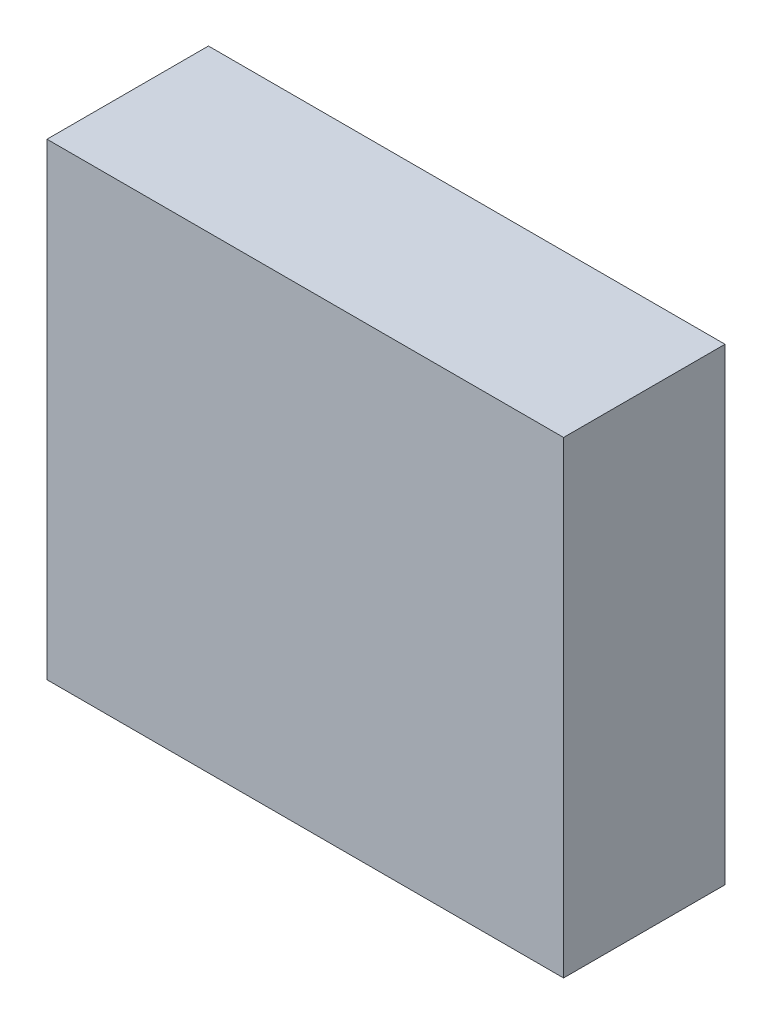
ISO-10303-21;
HEADER;
FILE_DESCRIPTION(('STEP AP214'),'2;1');
FILE_NAME('part.step','',(''),(''),'','','');
FILE_SCHEMA(('AUTOMOTIVE_DESIGN { 1 0 10303 214 1 1 1 1 }'));
ENDSEC;
DATA;
#1=APPLICATION_CONTEXT('core data for automotive mechanical design processes');
#2=APPLICATION_PROTOCOL_DEFINITION('international standard','automotive_design',2000,#1);
#3=PRODUCT_CONTEXT('',#1,'mechanical');
#4=PRODUCT('Part','Part','',(#3));
#5=PRODUCT_RELATED_PRODUCT_CATEGORY('part','',(#4));
#6=PRODUCT_DEFINITION_FORMATION('','',#4);
#7=PRODUCT_DEFINITION_CONTEXT('part definition',#1,'design');
#8=PRODUCT_DEFINITION('design','',#6,#7);
#9=PRODUCT_DEFINITION_SHAPE('','',#8);
#10=(LENGTH_UNIT() NAMED_UNIT(*) SI_UNIT(.MILLI.,.METRE.));
#11=(NAMED_UNIT(*) PLANE_ANGLE_UNIT() SI_UNIT($,.RADIAN.));
#12=(NAMED_UNIT(*) SI_UNIT($,.STERADIAN.) SOLID_ANGLE_UNIT());
#13=UNCERTAINTY_MEASURE_WITH_UNIT(LENGTH_MEASURE(1.E-05),#10,'distance_accuracy_value','');
#14=(GEOMETRIC_REPRESENTATION_CONTEXT(3) GLOBAL_UNCERTAINTY_ASSIGNED_CONTEXT((#13)) GLOBAL_UNIT_ASSIGNED_CONTEXT((#10,
#11,#12)) REPRESENTATION_CONTEXT('',''));
#15=CARTESIAN_POINT('',(0.,0.,0.));
#16=DIRECTION('',(0.,0.,1.));
#17=DIRECTION('',(1.,0.,0.));
#18=AXIS2_PLACEMENT_3D('',#15,#16,#17);
#19=CARTESIAN_POINT('',(-0.800018310546875,-0.724998474121094,-2.64111989736557));
#20=DIRECTION('',(0.,-1.,0.));
#21=DIRECTION('',(1.,0.,0.));
#22=AXIS2_PLACEMENT_3D('',#19,#20,#21);
#23=PLANE('',#22);
#24=DIRECTION('',(1.,0.,0.));
#25=VECTOR('',#24,1.);
#26=CARTESIAN_POINT('',(-0.800018310546875,-0.724998474121094,-2.64111989736557));
#27=LINE('',#26,#25);
#28=CARTESIAN_POINT('',(-0.800018310546875,-0.724998474121094,-2.64111989736557));
#29=VERTEX_POINT('',#28);
#30=CARTESIAN_POINT('',(0.800018310546875,-0.724998474121094,-2.64111989736557));
#31=VERTEX_POINT('',#30);
#32=EDGE_CURVE('E11',#29,#31,#27,.T.);
#33=ORIENTED_EDGE('',*,*,#32,.T.);
#34=DIRECTION('',(0.,0.,1.));
#35=VECTOR('',#34,1.);
#36=CARTESIAN_POINT('',(0.800018310546875,-0.724998474121094,-2.64111989736557));
#37=LINE('',#36,#35);
#38=CARTESIAN_POINT('',(0.800018310546875,-0.724998474121094,-2.14112091064453));
#39=VERTEX_POINT('',#38);
#40=EDGE_CURVE('E88',#31,#39,#37,.T.);
#41=ORIENTED_EDGE('',*,*,#40,.T.);
#42=DIRECTION('',(1.,0.,0.));
#43=VECTOR('',#42,1.);
#44=CARTESIAN_POINT('',(-0.800018310546875,-0.724998474121094,-2.14112091064453));
#45=LINE('',#44,#43);
#46=CARTESIAN_POINT('',(-0.800018310546875,-0.724998474121094,-2.14112091064453));
#47=VERTEX_POINT('',#46);
#48=EDGE_CURVE('E83',#47,#39,#45,.T.);
#49=ORIENTED_EDGE('',*,*,#48,.F.);
#50=DIRECTION('',(0.,0.,1.));
#51=VECTOR('',#50,1.);
#52=CARTESIAN_POINT('',(-0.800018310546875,-0.724998474121094,-2.64111989736557));
#53=LINE('',#52,#51);
#54=EDGE_CURVE('E72',#29,#47,#53,.T.);
#55=ORIENTED_EDGE('',*,*,#54,.F.);
#56=EDGE_LOOP('',(#33,#41,#49,#55));
#57=FACE_BOUND('',#56,.T.);
#58=ADVANCED_FACE('F17',(#57),#23,.T.);
#59=CARTESIAN_POINT('',(0.800018310546875,-0.724998474121094,-2.64111989736557));
#60=DIRECTION('',(1.,0.,0.));
#61=DIRECTION('',(0.,1.,0.));
#62=AXIS2_PLACEMENT_3D('',#59,#60,#61);
#63=PLANE('',#62);
#64=DIRECTION('',(0.,1.,0.));
#65=VECTOR('',#64,1.);
#66=CARTESIAN_POINT('',(0.800018310546875,-0.724998474121094,-2.64111989736557));
#67=LINE('',#66,#65);
#68=CARTESIAN_POINT('',(0.800018310546875,0.724998474121094,-2.64111989736557));
#69=VERTEX_POINT('',#68);
#70=EDGE_CURVE('E24',#31,#69,#67,.T.);
#71=ORIENTED_EDGE('',*,*,#70,.T.);
#72=DIRECTION('',(0.,0.,1.));
#73=VECTOR('',#72,1.);
#74=CARTESIAN_POINT('',(0.800018310546875,0.724998474121094,-2.64111989736557));
#75=LINE('',#74,#73);
#76=CARTESIAN_POINT('',(0.800018310546875,0.724998474121094,-2.14112091064453));
#77=VERTEX_POINT('',#76);
#78=EDGE_CURVE('E85',#69,#77,#75,.T.);
#79=ORIENTED_EDGE('',*,*,#78,.T.);
#80=DIRECTION('',(0.,1.,0.));
#81=VECTOR('',#80,1.);
#82=CARTESIAN_POINT('',(0.800018310546875,-0.724998474121094,-2.14112091064453));
#83=LINE('',#82,#81);
#84=EDGE_CURVE('E66',#39,#77,#83,.T.);
#85=ORIENTED_EDGE('',*,*,#84,.F.);
#86=ORIENTED_EDGE('',*,*,#40,.F.);
#87=EDGE_LOOP('',(#71,#79,#85,#86));
#88=FACE_BOUND('',#87,.T.);
#89=ADVANCED_FACE('F89',(#88),#63,.T.);
#90=CARTESIAN_POINT('',(0.800018310546875,0.724998474121094,-2.64111989736557));
#91=DIRECTION('',(0.,1.,0.));
#92=DIRECTION('',(-1.,0.,0.));
#93=AXIS2_PLACEMENT_3D('',#90,#91,#92);
#94=PLANE('',#93);
#95=DIRECTION('',(-1.,0.,0.));
#96=VECTOR('',#95,1.);
#97=CARTESIAN_POINT('',(0.800018310546875,0.724998474121094,-2.64111989736557));
#98=LINE('',#97,#96);
#99=CARTESIAN_POINT('',(-0.800018310546875,0.724998474121094,-2.64111989736557));
#100=VERTEX_POINT('',#99);
#101=EDGE_CURVE('E62',#69,#100,#98,.T.);
#102=ORIENTED_EDGE('',*,*,#101,.T.);
#103=DIRECTION('',(0.,0.,1.));
#104=VECTOR('',#103,1.);
#105=CARTESIAN_POINT('',(-0.800018310546875,0.724998474121094,-2.64111989736557));
#106=LINE('',#105,#104);
#107=CARTESIAN_POINT('',(-0.800018310546875,0.724998474121094,-2.14112091064453));
#108=VERTEX_POINT('',#107);
#109=EDGE_CURVE('E55',#100,#108,#106,.T.);
#110=ORIENTED_EDGE('',*,*,#109,.T.);
#111=DIRECTION('',(-1.,0.,0.));
#112=VECTOR('',#111,1.);
#113=CARTESIAN_POINT('',(0.800018310546875,0.724998474121094,-2.14112091064453));
#114=LINE('',#113,#112);
#115=EDGE_CURVE('E59',#77,#108,#114,.T.);
#116=ORIENTED_EDGE('',*,*,#115,.F.);
#117=ORIENTED_EDGE('',*,*,#78,.F.);
#118=EDGE_LOOP('',(#102,#110,#116,#117));
#119=FACE_BOUND('',#118,.T.);
#120=ADVANCED_FACE('F57',(#119),#94,.T.);
#121=CARTESIAN_POINT('',(-0.800018310546875,0.724998474121094,-2.64111989736557));
#122=DIRECTION('',(-1.,0.,0.));
#123=DIRECTION('',(0.,-1.,0.));
#124=AXIS2_PLACEMENT_3D('',#121,#122,#123);
#125=PLANE('',#124);
#126=DIRECTION('',(0.,-1.,0.));
#127=VECTOR('',#126,1.);
#128=CARTESIAN_POINT('',(-0.800018310546875,0.724998474121094,-2.64111989736557));
#129=LINE('',#128,#127);
#130=EDGE_CURVE('E65',#100,#29,#129,.T.);
#131=ORIENTED_EDGE('',*,*,#130,.T.);
#132=ORIENTED_EDGE('',*,*,#54,.T.);
#133=DIRECTION('',(0.,-1.,0.));
#134=VECTOR('',#133,1.);
#135=CARTESIAN_POINT('',(-0.800018310546875,0.724998474121094,-2.14112091064453));
#136=LINE('',#135,#134);
#137=EDGE_CURVE('E70',#108,#47,#136,.T.);
#138=ORIENTED_EDGE('',*,*,#137,.F.);
#139=ORIENTED_EDGE('',*,*,#109,.F.);
#140=EDGE_LOOP('',(#131,#132,#138,#139));
#141=FACE_BOUND('',#140,.T.);
#142=ADVANCED_FACE('F71',(#141),#125,.T.);
#143=CARTESIAN_POINT('',(-376.649993896484,-95.8000030517578,-2.14112091064453));
#144=DIRECTION('',(0.,0.,1.));
#145=DIRECTION('',(1.,0.,0.));
#146=AXIS2_PLACEMENT_3D('',#143,#144,#145);
#147=PLANE('',#146);
#148=ORIENTED_EDGE('',*,*,#48,.T.);
#149=ORIENTED_EDGE('',*,*,#84,.T.);
#150=ORIENTED_EDGE('',*,*,#115,.T.);
#151=ORIENTED_EDGE('',*,*,#137,.T.);
#152=EDGE_LOOP('',(#148,#149,#150,#151));
#153=FACE_BOUND('',#152,.T.);
#154=ADVANCED_FACE('F76',(#153),#147,.T.);
#155=CARTESIAN_POINT('',(-376.649993896484,-95.8000030517578,-2.64111989736557));
#156=DIRECTION('',(0.,0.,1.));
#157=DIRECTION('',(1.,0.,0.));
#158=AXIS2_PLACEMENT_3D('',#155,#156,#157);
#159=PLANE('',#158);
#160=ORIENTED_EDGE('',*,*,#130,.F.);
#161=ORIENTED_EDGE('',*,*,#101,.F.);
#162=ORIENTED_EDGE('',*,*,#70,.F.);
#163=ORIENTED_EDGE('',*,*,#32,.F.);
#164=EDGE_LOOP('',(#160,#161,#162,#163));
#165=FACE_BOUND('',#164,.T.);
#166=ADVANCED_FACE('F91',(#165),#159,.F.);
#167=CLOSED_SHELL('',(#58,#89,#120,#142,#154,#166));
#168=MANIFOLD_SOLID_BREP('B1',#167);
#169=ADVANCED_BREP_SHAPE_REPRESENTATION('',(#18,#168),#14);
#170=SHAPE_DEFINITION_REPRESENTATION(#9,#169);
ENDSEC;
END-ISO-10303-21;
